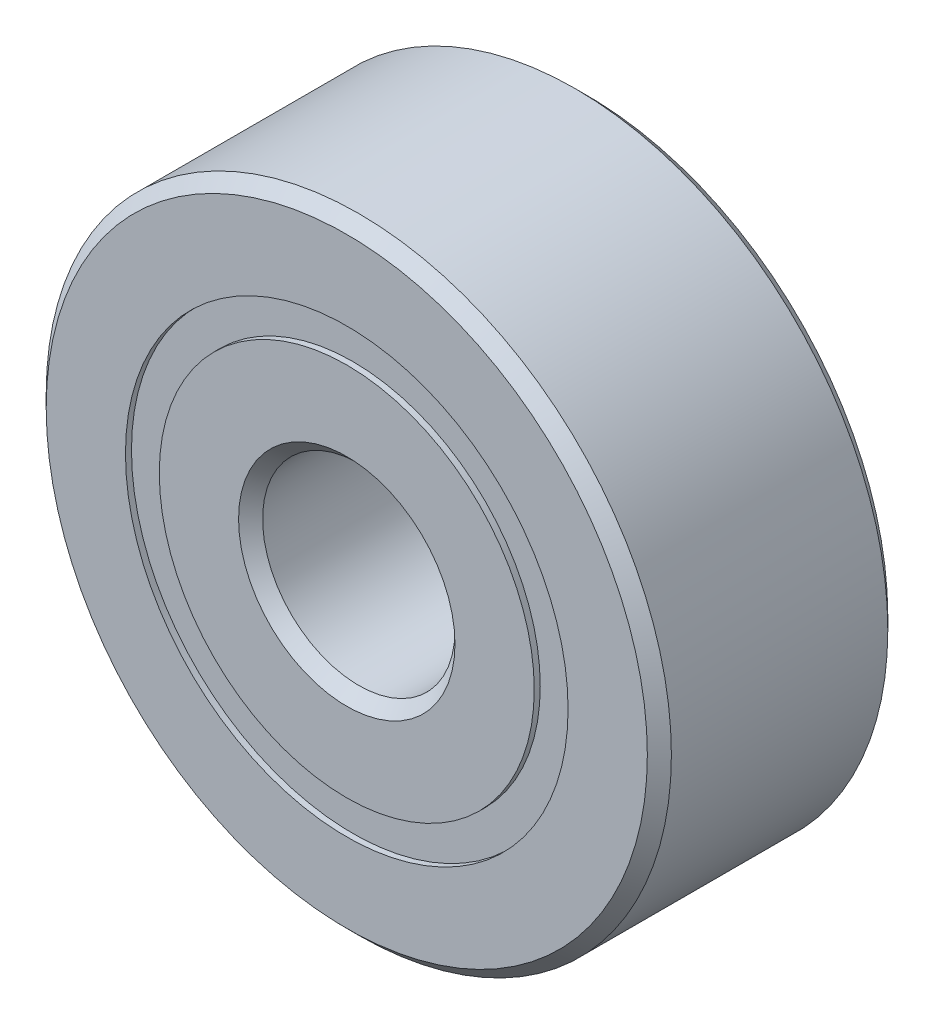
ISO-10303-21;
HEADER;
FILE_DESCRIPTION(('STEP AP214'),'2;1');
FILE_NAME('part.step','',(''),(''),'','','');
FILE_SCHEMA(('AUTOMOTIVE_DESIGN { 1 0 10303 214 1 1 1 1 }'));
ENDSEC;
DATA;
#1=APPLICATION_CONTEXT('core data for automotive mechanical design processes');
#2=APPLICATION_PROTOCOL_DEFINITION('international standard','automotive_design',2000,#1);
#3=PRODUCT_CONTEXT('',#1,'mechanical');
#4=PRODUCT('Part','Part','',(#3));
#5=PRODUCT_RELATED_PRODUCT_CATEGORY('part','',(#4));
#6=PRODUCT_DEFINITION_FORMATION('','',#4);
#7=PRODUCT_DEFINITION_CONTEXT('part definition',#1,'design');
#8=PRODUCT_DEFINITION('design','',#6,#7);
#9=PRODUCT_DEFINITION_SHAPE('','',#8);
#10=(LENGTH_UNIT() NAMED_UNIT(*) SI_UNIT(.MILLI.,.METRE.));
#11=(NAMED_UNIT(*) PLANE_ANGLE_UNIT() SI_UNIT($,.RADIAN.));
#12=(NAMED_UNIT(*) SI_UNIT($,.STERADIAN.) SOLID_ANGLE_UNIT());
#13=UNCERTAINTY_MEASURE_WITH_UNIT(LENGTH_MEASURE(1.E-05),#10,'distance_accuracy_value','');
#14=(GEOMETRIC_REPRESENTATION_CONTEXT(3) GLOBAL_UNCERTAINTY_ASSIGNED_CONTEXT((#13)) GLOBAL_UNIT_ASSIGNED_CONTEXT((#10,
#11,#12)) REPRESENTATION_CONTEXT('',''));
#15=CARTESIAN_POINT('',(0.,0.,0.));
#16=DIRECTION('',(0.,0.,1.));
#17=DIRECTION('',(1.,0.,0.));
#18=AXIS2_PLACEMENT_3D('',#15,#16,#17);
#19=CARTESIAN_POINT('',(0.,4.60164835164835,-2.375));
#20=DIRECTION('',(0.,0.,1.));
#21=DIRECTION('',(1.,0.,0.));
#22=AXIS2_PLACEMENT_3D('',#19,#20,#21);
#23=PLANE('',#22);
#24=CARTESIAN_POINT('',(0.,0.,-2.375));
#25=DIRECTION('',(0.,0.,1.));
#26=DIRECTION('',(1.,0.,0.));
#27=AXIS2_PLACEMENT_3D('',#24,#25,#26);
#28=CIRCLE('',#27,4.60164835164835);
#29=CARTESIAN_POINT('',(4.60164835164835,0.,-2.375));
#30=VERTEX_POINT('',#29);
#31=EDGE_CURVE('E64',#30,#30,#28,.T.);
#32=ORIENTED_EDGE('',*,*,#31,.F.);
#33=EDGE_LOOP('',(#32));
#34=FACE_BOUND('',#33,.T.);
#35=CARTESIAN_POINT('',(0.,0.,-2.375));
#36=DIRECTION('',(0.,0.,1.));
#37=DIRECTION('',(1.,0.,0.));
#38=AXIS2_PLACEMENT_3D('',#35,#36,#37);
#39=CIRCLE('',#38,3.89835164835165);
#40=CARTESIAN_POINT('',(3.89835164835165,0.,-2.375));
#41=VERTEX_POINT('',#40);
#42=EDGE_CURVE('E11',#41,#41,#39,.T.);
#43=ORIENTED_EDGE('',*,*,#42,.T.);
#44=EDGE_LOOP('',(#43));
#45=FACE_BOUND('',#44,.T.);
#46=ADVANCED_FACE('F50',(#34,#45),#23,.F.);
#47=CARTESIAN_POINT('',(0.,0.,2.5));
#48=DIRECTION('',(0.,0.,1.));
#49=DIRECTION('',(1.,0.,0.));
#50=AXIS2_PLACEMENT_3D('',#47,#48,#49);
#51=CYLINDRICAL_SURFACE('',#50,3.89835164835165);
#52=ORIENTED_EDGE('',*,*,#42,.F.);
#53=EDGE_LOOP('',(#52));
#54=FACE_BOUND('',#53,.T.);
#55=CARTESIAN_POINT('',(0.,0.,-1.16542887575844));
#56=DIRECTION('',(0.,0.,1.));
#57=DIRECTION('',(1.,0.,0.));
#58=AXIS2_PLACEMENT_3D('',#55,#56,#57);
#59=CIRCLE('',#58,3.89835164835165);
#60=CARTESIAN_POINT('',(3.89835164835165,0.,-1.16542887575844));
#61=VERTEX_POINT('',#60);
#62=EDGE_CURVE('E56',#61,#61,#59,.T.);
#63=ORIENTED_EDGE('',*,*,#62,.T.);
#64=EDGE_LOOP('',(#63));
#65=FACE_BOUND('',#64,.T.);
#66=ADVANCED_FACE('F73',(#54,#65),#51,.F.);
#67=CARTESIAN_POINT('',(0.,4.60164835164835,-1.16542887575844));
#68=DIRECTION('',(0.,0.,-1.));
#69=DIRECTION('',(-1.,0.,0.));
#70=AXIS2_PLACEMENT_3D('',#67,#68,#69);
#71=PLANE('',#70);
#72=ORIENTED_EDGE('',*,*,#62,.F.);
#73=EDGE_LOOP('',(#72));
#74=FACE_BOUND('',#73,.T.);
#75=CARTESIAN_POINT('',(0.,0.,-1.16542887575844));
#76=DIRECTION('',(0.,0.,1.));
#77=DIRECTION('',(1.,0.,0.));
#78=AXIS2_PLACEMENT_3D('',#75,#76,#77);
#79=CIRCLE('',#78,4.60164835164835);
#80=CARTESIAN_POINT('',(4.60164835164835,0.,-1.16542887575844));
#81=VERTEX_POINT('',#80);
#82=EDGE_CURVE('E60',#81,#81,#79,.T.);
#83=ORIENTED_EDGE('',*,*,#82,.T.);
#84=EDGE_LOOP('',(#83));
#85=FACE_BOUND('',#84,.T.);
#86=ADVANCED_FACE('F77',(#74,#85),#71,.F.);
#87=CARTESIAN_POINT('',(0.,0.,2.5));
#88=DIRECTION('',(0.,0.,1.));
#89=DIRECTION('',(1.,0.,0.));
#90=AXIS2_PLACEMENT_3D('',#87,#88,#89);
#91=CYLINDRICAL_SURFACE('',#90,4.60164835164835);
#92=ORIENTED_EDGE('',*,*,#82,.F.);
#93=EDGE_LOOP('',(#92));
#94=FACE_BOUND('',#93,.T.);
#95=ORIENTED_EDGE('',*,*,#31,.T.);
#96=EDGE_LOOP('',(#95));
#97=FACE_BOUND('',#96,.T.);
#98=ADVANCED_FACE('F70',(#94,#97),#91,.T.);
#99=CLOSED_SHELL('',(#46,#66,#86,#98));
#100=MANIFOLD_SOLID_BREP('B2',#99);
#101=CARTESIAN_POINT('',(0.,4.60164835164835,2.375));
#102=DIRECTION('',(0.,0.,-1.));
#103=DIRECTION('',(-1.,0.,0.));
#104=AXIS2_PLACEMENT_3D('',#101,#102,#103);
#105=PLANE('',#104);
#106=CARTESIAN_POINT('',(0.,0.,2.375));
#107=DIRECTION('',(0.,0.,1.));
#108=DIRECTION('',(1.,0.,0.));
#109=AXIS2_PLACEMENT_3D('',#106,#107,#108);
#110=CIRCLE('',#109,3.89835164835165);
#111=CARTESIAN_POINT('',(3.89835164835165,0.,2.375));
#112=VERTEX_POINT('',#111);
#113=EDGE_CURVE('E49',#112,#112,#110,.T.);
#114=ORIENTED_EDGE('',*,*,#113,.F.);
#115=EDGE_LOOP('',(#114));
#116=FACE_BOUND('',#115,.T.);
#117=CARTESIAN_POINT('',(0.,0.,2.375));
#118=DIRECTION('',(0.,0.,1.));
#119=DIRECTION('',(1.,0.,0.));
#120=AXIS2_PLACEMENT_3D('',#117,#118,#119);
#121=CIRCLE('',#120,4.60164835164835);
#122=CARTESIAN_POINT('',(4.60164835164835,0.,2.375));
#123=VERTEX_POINT('',#122);
#124=EDGE_CURVE('E124',#123,#123,#121,.T.);
#125=ORIENTED_EDGE('',*,*,#124,.T.);
#126=EDGE_LOOP('',(#125));
#127=FACE_BOUND('',#126,.T.);
#128=ADVANCED_FACE('F110',(#116,#127),#105,.F.);
#129=CARTESIAN_POINT('',(0.,0.,2.5));
#130=DIRECTION('',(0.,0.,1.));
#131=DIRECTION('',(1.,0.,0.));
#132=AXIS2_PLACEMENT_3D('',#129,#130,#131);
#133=CYLINDRICAL_SURFACE('',#132,3.89835164835165);
#134=CARTESIAN_POINT('',(0.,0.,1.16542887575844));
#135=DIRECTION('',(0.,0.,1.));
#136=DIRECTION('',(1.,0.,0.));
#137=AXIS2_PLACEMENT_3D('',#134,#135,#136);
#138=CIRCLE('',#137,3.89835164835165);
#139=CARTESIAN_POINT('',(3.89835164835165,0.,1.16542887575844));
#140=VERTEX_POINT('',#139);
#141=EDGE_CURVE('E116',#140,#140,#138,.T.);
#142=ORIENTED_EDGE('',*,*,#141,.F.);
#143=EDGE_LOOP('',(#142));
#144=FACE_BOUND('',#143,.T.);
#145=ORIENTED_EDGE('',*,*,#113,.T.);
#146=EDGE_LOOP('',(#145));
#147=FACE_BOUND('',#146,.T.);
#148=ADVANCED_FACE('F139',(#144,#147),#133,.F.);
#149=CARTESIAN_POINT('',(0.,4.60164835164835,1.16542887575844));
#150=DIRECTION('',(0.,0.,1.));
#151=DIRECTION('',(1.,0.,0.));
#152=AXIS2_PLACEMENT_3D('',#149,#150,#151);
#153=PLANE('',#152);
#154=CARTESIAN_POINT('',(0.,0.,1.16542887575844));
#155=DIRECTION('',(0.,0.,1.));
#156=DIRECTION('',(1.,0.,0.));
#157=AXIS2_PLACEMENT_3D('',#154,#155,#156);
#158=CIRCLE('',#157,4.60164835164835);
#159=CARTESIAN_POINT('',(4.60164835164835,0.,1.16542887575844));
#160=VERTEX_POINT('',#159);
#161=EDGE_CURVE('E120',#160,#160,#158,.T.);
#162=ORIENTED_EDGE('',*,*,#161,.F.);
#163=EDGE_LOOP('',(#162));
#164=FACE_BOUND('',#163,.T.);
#165=ORIENTED_EDGE('',*,*,#141,.T.);
#166=EDGE_LOOP('',(#165));
#167=FACE_BOUND('',#166,.T.);
#168=ADVANCED_FACE('F134',(#164,#167),#153,.F.);
#169=CARTESIAN_POINT('',(0.,0.,2.5));
#170=DIRECTION('',(0.,0.,1.));
#171=DIRECTION('',(1.,0.,0.));
#172=AXIS2_PLACEMENT_3D('',#169,#170,#171);
#173=CYLINDRICAL_SURFACE('',#172,4.60164835164835);
#174=ORIENTED_EDGE('',*,*,#124,.F.);
#175=EDGE_LOOP('',(#174));
#176=FACE_BOUND('',#175,.T.);
#177=ORIENTED_EDGE('',*,*,#161,.T.);
#178=EDGE_LOOP('',(#177));
#179=FACE_BOUND('',#178,.T.);
#180=ADVANCED_FACE('F131',(#176,#179),#173,.T.);
#181=CLOSED_SHELL('',(#128,#148,#168,#180));
#182=MANIFOLD_SOLID_BREP('B6',#181);
#183=CARTESIAN_POINT('',(-2.12499999999995,3.68060796608389,0.));
#184=DIRECTION('',(0.,0.,1.));
#185=DIRECTION('',(-0.499999999999989,0.866025403784445,0.));
#186=AXIS2_PLACEMENT_3D('',#183,#184,#185);
#187=SPHERICAL_SURFACE('',#186,1.16542887575844);
#188=CARTESIAN_POINT('',(-2.12499999999995,3.68060796608389,1.16542887575844));
#189=VERTEX_POINT('',#188);
#190=VERTEX_LOOP('',#189);
#191=FACE_BOUND('',#190,.T.);
#192=ADVANCED_FACE('F170',(#191),#187,.T.);
#193=CLOSED_SHELL('',(#192));
#194=MANIFOLD_SOLID_BREP('B44',#193);
#195=CARTESIAN_POINT('',(-3.68060796608384,2.12500000000004,0.));
#196=DIRECTION('',(0.,0.,1.));
#197=DIRECTION('',(-0.866025403784433,0.50000000000001,0.));
#198=AXIS2_PLACEMENT_3D('',#195,#196,#197);
#199=SPHERICAL_SURFACE('',#198,1.16542887575844);
#200=CARTESIAN_POINT('',(-3.68060796608384,2.12500000000004,1.16542887575844));
#201=VERTEX_POINT('',#200);
#202=VERTEX_LOOP('',#201);
#203=FACE_BOUND('',#202,.T.);
#204=ADVANCED_FACE('F193',(#203),#199,.T.);
#205=CLOSED_SHELL('',(#204));
#206=MANIFOLD_SOLID_BREP('B106',#205);
#207=CARTESIAN_POINT('',(-4.25,0.,0.));
#208=DIRECTION('',(0.,0.,1.));
#209=DIRECTION('',(-1.,0.,0.));
#210=AXIS2_PLACEMENT_3D('',#207,#208,#209);
#211=SPHERICAL_SURFACE('',#210,1.16542887575844);
#212=CARTESIAN_POINT('',(-4.25,0.,1.16542887575844));
#213=VERTEX_POINT('',#212);
#214=VERTEX_LOOP('',#213);
#215=FACE_BOUND('',#214,.T.);
#216=ADVANCED_FACE('F216',(#215),#211,.T.);
#217=CLOSED_SHELL('',(#216));
#218=MANIFOLD_SOLID_BREP('B166',#217);
#219=CARTESIAN_POINT('',(-3.68060796608388,-2.12499999999997,0.));
#220=DIRECTION('',(0.,0.,1.));
#221=DIRECTION('',(-0.866025403784443,-0.499999999999992,0.));
#222=AXIS2_PLACEMENT_3D('',#219,#220,#221);
#223=SPHERICAL_SURFACE('',#222,1.16542887575844);
#224=CARTESIAN_POINT('',(-3.68060796608388,-2.12499999999997,1.16542887575844));
#225=VERTEX_POINT('',#224);
#226=VERTEX_LOOP('',#225);
#227=FACE_BOUND('',#226,.T.);
#228=ADVANCED_FACE('F239',(#227),#223,.T.);
#229=CLOSED_SHELL('',(#228));
#230=MANIFOLD_SOLID_BREP('B189',#229);
#231=CARTESIAN_POINT('',(-2.12500000000003,-3.68060796608385,0.));
#232=DIRECTION('',(0.,0.,1.));
#233=DIRECTION('',(-0.500000000000007,-0.866025403784435,0.));
#234=AXIS2_PLACEMENT_3D('',#231,#232,#233);
#235=SPHERICAL_SURFACE('',#234,1.16542887575844);
#236=CARTESIAN_POINT('',(-2.12500000000003,-3.68060796608385,1.16542887575844));
#237=VERTEX_POINT('',#236);
#238=VERTEX_LOOP('',#237);
#239=FACE_BOUND('',#238,.T.);
#240=ADVANCED_FACE('F262',(#239),#235,.T.);
#241=CLOSED_SHELL('',(#240));
#242=MANIFOLD_SOLID_BREP('B212',#241);
#243=CARTESIAN_POINT('',(0.,-4.25,0.));
#244=DIRECTION('',(0.,0.,1.));
#245=DIRECTION('',(0.,-1.,0.));
#246=AXIS2_PLACEMENT_3D('',#243,#244,#245);
#247=SPHERICAL_SURFACE('',#246,1.16542887575844);
#248=CARTESIAN_POINT('',(0.,-4.25,1.16542887575844));
#249=VERTEX_POINT('',#248);
#250=VERTEX_LOOP('',#249);
#251=FACE_BOUND('',#250,.T.);
#252=ADVANCED_FACE('F285',(#251),#247,.T.);
#253=CLOSED_SHELL('',(#252));
#254=MANIFOLD_SOLID_BREP('B235',#253);
#255=CARTESIAN_POINT('',(2.12499999999998,-3.68060796608388,0.));
#256=DIRECTION('',(0.,0.,1.));
#257=DIRECTION('',(0.499999999999995,-0.866025403784442,0.));
#258=AXIS2_PLACEMENT_3D('',#255,#256,#257);
#259=SPHERICAL_SURFACE('',#258,1.16542887575844);
#260=CARTESIAN_POINT('',(2.12499999999998,-3.68060796608388,1.16542887575844));
#261=VERTEX_POINT('',#260);
#262=VERTEX_LOOP('',#261);
#263=FACE_BOUND('',#262,.T.);
#264=ADVANCED_FACE('F308',(#263),#259,.T.);
#265=CLOSED_SHELL('',(#264));
#266=MANIFOLD_SOLID_BREP('B258',#265);
#267=CARTESIAN_POINT('',(3.68060796608386,-2.12500000000002,0.));
#268=DIRECTION('',(0.,0.,1.));
#269=DIRECTION('',(0.866025403784436,-0.500000000000004,0.));
#270=AXIS2_PLACEMENT_3D('',#267,#268,#269);
#271=SPHERICAL_SURFACE('',#270,1.16542887575844);
#272=CARTESIAN_POINT('',(3.68060796608386,-2.12500000000002,1.16542887575844));
#273=VERTEX_POINT('',#272);
#274=VERTEX_LOOP('',#273);
#275=FACE_BOUND('',#274,.T.);
#276=ADVANCED_FACE('F331',(#275),#271,.T.);
#277=CLOSED_SHELL('',(#276));
#278=MANIFOLD_SOLID_BREP('B281',#277);
#279=CARTESIAN_POINT('',(4.25,0.,0.));
#280=DIRECTION('',(0.,0.,1.));
#281=DIRECTION('',(1.,0.,0.));
#282=AXIS2_PLACEMENT_3D('',#279,#280,#281);
#283=SPHERICAL_SURFACE('',#282,1.16542887575844);
#284=CARTESIAN_POINT('',(4.25,0.,1.16542887575844));
#285=VERTEX_POINT('',#284);
#286=VERTEX_LOOP('',#285);
#287=FACE_BOUND('',#286,.T.);
#288=ADVANCED_FACE('F354',(#287),#283,.T.);
#289=CLOSED_SHELL('',(#288));
#290=MANIFOLD_SOLID_BREP('B304',#289);
#291=CARTESIAN_POINT('',(3.68060796608387,2.12499999999999,0.));
#292=DIRECTION('',(0.,0.,1.));
#293=DIRECTION('',(0.86602540378444,0.499999999999998,0.));
#294=AXIS2_PLACEMENT_3D('',#291,#292,#293);
#295=SPHERICAL_SURFACE('',#294,1.16542887575844);
#296=CARTESIAN_POINT('',(3.68060796608387,2.12499999999999,1.16542887575844));
#297=VERTEX_POINT('',#296);
#298=VERTEX_LOOP('',#297);
#299=FACE_BOUND('',#298,.T.);
#300=ADVANCED_FACE('F377',(#299),#295,.T.);
#301=CLOSED_SHELL('',(#300));
#302=MANIFOLD_SOLID_BREP('B327',#301);
#303=CARTESIAN_POINT('',(2.125,3.68060796608386,0.));
#304=DIRECTION('',(0.,0.,1.));
#305=DIRECTION('',(0.500000000000001,0.866025403784438,0.));
#306=AXIS2_PLACEMENT_3D('',#303,#304,#305);
#307=SPHERICAL_SURFACE('',#306,1.16542887575844);
#308=CARTESIAN_POINT('',(2.125,3.68060796608386,1.16542887575844));
#309=VERTEX_POINT('',#308);
#310=VERTEX_LOOP('',#309);
#311=FACE_BOUND('',#310,.T.);
#312=ADVANCED_FACE('F400',(#311),#307,.T.);
#313=CLOSED_SHELL('',(#312));
#314=MANIFOLD_SOLID_BREP('B350',#313);
#315=CARTESIAN_POINT('',(0.,4.25,0.));
#316=DIRECTION('',(0.,0.,1.));
#317=DIRECTION('',(0.,1.,0.));
#318=AXIS2_PLACEMENT_3D('',#315,#316,#317);
#319=SPHERICAL_SURFACE('',#318,1.16542887575844);
#320=CARTESIAN_POINT('',(0.,4.25,1.16542887575844));
#321=VERTEX_POINT('',#320);
#322=VERTEX_LOOP('',#321);
#323=FACE_BOUND('',#322,.T.);
#324=ADVANCED_FACE('F425',(#323),#319,.T.);
#325=CLOSED_SHELL('',(#324));
#326=MANIFOLD_SOLID_BREP('B373',#325);
#327=CARTESIAN_POINT('',(0.,3.89835164835165,2.5));
#328=DIRECTION('',(0.,0.,-1.));
#329=DIRECTION('',(-1.,0.,0.));
#330=AXIS2_PLACEMENT_3D('',#327,#328,#329);
#331=PLANE('',#330);
#332=CARTESIAN_POINT('',(0.,0.,2.5));
#333=DIRECTION('',(0.,0.,1.));
#334=DIRECTION('',(1.,0.,0.));
#335=AXIS2_PLACEMENT_3D('',#332,#333,#334);
#336=CIRCLE('',#335,2.25);
#337=CARTESIAN_POINT('',(2.25,0.,2.5));
#338=VERTEX_POINT('',#337);
#339=EDGE_CURVE('E471',#338,#338,#336,.T.);
#340=ORIENTED_EDGE('',*,*,#339,.F.);
#341=EDGE_LOOP('',(#340));
#342=FACE_BOUND('',#341,.T.);
#343=CARTESIAN_POINT('',(0.,0.,2.5));
#344=DIRECTION('',(0.,0.,1.));
#345=DIRECTION('',(1.,0.,0.));
#346=AXIS2_PLACEMENT_3D('',#343,#344,#345);
#347=CIRCLE('',#346,3.89835164835165);
#348=CARTESIAN_POINT('',(3.89835164835165,0.,2.5));
#349=VERTEX_POINT('',#348);
#350=EDGE_CURVE('E424',#349,#349,#347,.T.);
#351=ORIENTED_EDGE('',*,*,#350,.T.);
#352=EDGE_LOOP('',(#351));
#353=FACE_BOUND('',#352,.T.);
#354=ADVANCED_FACE('F443',(#342,#353),#331,.F.);
#355=CARTESIAN_POINT('',(0.,0.,2.5));
#356=DIRECTION('',(0.,0.,1.));
#357=DIRECTION('',(1.,0.,0.));
#358=AXIS2_PLACEMENT_3D('',#355,#356,#357);
#359=CYLINDRICAL_SURFACE('',#358,3.89835164835165);
#360=ORIENTED_EDGE('',*,*,#350,.F.);
#361=EDGE_LOOP('',(#360));
#362=FACE_BOUND('',#361,.T.);
#363=CARTESIAN_POINT('',(0.,0.,1.11111111111111));
#364=DIRECTION('',(0.,0.,1.));
#365=DIRECTION('',(1.,0.,0.));
#366=AXIS2_PLACEMENT_3D('',#363,#364,#365);
#367=CIRCLE('',#366,3.89835164835165);
#368=CARTESIAN_POINT('',(3.89835164835165,0.,1.11111111111111));
#369=VERTEX_POINT('',#368);
#370=EDGE_CURVE('E449',#369,#369,#367,.T.);
#371=ORIENTED_EDGE('',*,*,#370,.T.);
#372=EDGE_LOOP('',(#371));
#373=FACE_BOUND('',#372,.T.);
#374=ADVANCED_FACE('F478',(#362,#373),#359,.T.);
#375=CARTESIAN_POINT('',(0.,0.,0.));
#376=DIRECTION('',(0.,0.,1.));
#377=DIRECTION('',(1.,0.,0.));
#378=AXIS2_PLACEMENT_3D('',#375,#376,#377);
#379=TOROIDAL_SURFACE('',#378,4.25,1.16542887575843);
#380=ORIENTED_EDGE('',*,*,#370,.F.);
#381=EDGE_LOOP('',(#380));
#382=FACE_BOUND('',#381,.T.);
#383=CARTESIAN_POINT('',(0.,0.,-1.11111111111111));
#384=DIRECTION('',(0.,0.,1.));
#385=DIRECTION('',(1.,0.,0.));
#386=AXIS2_PLACEMENT_3D('',#383,#384,#385);
#387=CIRCLE('',#386,3.89835164835165);
#388=CARTESIAN_POINT('',(3.89835164835165,0.,-1.11111111111111));
#389=VERTEX_POINT('',#388);
#390=EDGE_CURVE('E453',#389,#389,#387,.T.);
#391=ORIENTED_EDGE('',*,*,#390,.T.);
#392=EDGE_LOOP('',(#391));
#393=FACE_BOUND('',#392,.T.);
#394=ADVANCED_FACE('F482',(#382,#393),#379,.F.);
#395=CARTESIAN_POINT('',(0.,0.,2.5));
#396=DIRECTION('',(0.,0.,1.));
#397=DIRECTION('',(1.,0.,0.));
#398=AXIS2_PLACEMENT_3D('',#395,#396,#397);
#399=CYLINDRICAL_SURFACE('',#398,3.89835164835165);
#400=ORIENTED_EDGE('',*,*,#390,.F.);
#401=EDGE_LOOP('',(#400));
#402=FACE_BOUND('',#401,.T.);
#403=CARTESIAN_POINT('',(0.,0.,-2.5));
#404=DIRECTION('',(0.,0.,1.));
#405=DIRECTION('',(1.,0.,0.));
#406=AXIS2_PLACEMENT_3D('',#403,#404,#405);
#407=CIRCLE('',#406,3.89835164835165);
#408=CARTESIAN_POINT('',(3.89835164835165,0.,-2.5));
#409=VERTEX_POINT('',#408);
#410=EDGE_CURVE('E457',#409,#409,#407,.T.);
#411=ORIENTED_EDGE('',*,*,#410,.T.);
#412=EDGE_LOOP('',(#411));
#413=FACE_BOUND('',#412,.T.);
#414=ADVANCED_FACE('F487',(#402,#413),#399,.T.);
#415=CARTESIAN_POINT('',(0.,2.25,-2.5));
#416=DIRECTION('',(0.,0.,1.));
#417=DIRECTION('',(1.,0.,0.));
#418=AXIS2_PLACEMENT_3D('',#415,#416,#417);
#419=PLANE('',#418);
#420=ORIENTED_EDGE('',*,*,#410,.F.);
#421=EDGE_LOOP('',(#420));
#422=FACE_BOUND('',#421,.T.);
#423=CARTESIAN_POINT('',(0.,0.,-2.5));
#424=DIRECTION('',(0.,0.,1.));
#425=DIRECTION('',(1.,0.,0.));
#426=AXIS2_PLACEMENT_3D('',#423,#424,#425);
#427=CIRCLE('',#426,2.25);
#428=CARTESIAN_POINT('',(2.25,0.,-2.5));
#429=VERTEX_POINT('',#428);
#430=EDGE_CURVE('E462',#429,#429,#427,.T.);
#431=ORIENTED_EDGE('',*,*,#430,.T.);
#432=EDGE_LOOP('',(#431));
#433=FACE_BOUND('',#432,.T.);
#434=ADVANCED_FACE('F493',(#422,#433),#419,.F.);
#435=CARTESIAN_POINT('',(0.,0.,-2.25));
#436=DIRECTION('',(0.,0.,-1.));
#437=DIRECTION('',(-1.,0.,0.));
#438=AXIS2_PLACEMENT_3D('',#435,#436,#437);
#439=CONICAL_SURFACE('',#438,2.,0.785398163397445);
#440=ORIENTED_EDGE('',*,*,#430,.F.);
#441=EDGE_LOOP('',(#440));
#442=FACE_BOUND('',#441,.T.);
#443=CARTESIAN_POINT('',(0.,0.,-2.25));
#444=DIRECTION('',(0.,0.,1.));
#445=DIRECTION('',(1.,0.,0.));
#446=AXIS2_PLACEMENT_3D('',#443,#444,#445);
#447=CIRCLE('',#446,2.);
#448=CARTESIAN_POINT('',(2.,0.,-2.25));
#449=VERTEX_POINT('',#448);
#450=EDGE_CURVE('E465',#449,#449,#447,.T.);
#451=ORIENTED_EDGE('',*,*,#450,.T.);
#452=EDGE_LOOP('',(#451));
#453=FACE_BOUND('',#452,.T.);
#454=ADVANCED_FACE('F497',(#442,#453),#439,.F.);
#455=CARTESIAN_POINT('',(0.,0.,2.5));
#456=DIRECTION('',(0.,0.,1.));
#457=DIRECTION('',(1.,0.,0.));
#458=AXIS2_PLACEMENT_3D('',#455,#456,#457);
#459=CYLINDRICAL_SURFACE('',#458,2.);
#460=ORIENTED_EDGE('',*,*,#450,.F.);
#461=EDGE_LOOP('',(#460));
#462=FACE_BOUND('',#461,.T.);
#463=CARTESIAN_POINT('',(0.,0.,2.25));
#464=DIRECTION('',(0.,0.,1.));
#465=DIRECTION('',(1.,0.,0.));
#466=AXIS2_PLACEMENT_3D('',#463,#464,#465);
#467=CIRCLE('',#466,2.);
#468=CARTESIAN_POINT('',(2.,0.,2.25));
#469=VERTEX_POINT('',#468);
#470=EDGE_CURVE('E468',#469,#469,#467,.T.);
#471=ORIENTED_EDGE('',*,*,#470,.T.);
#472=EDGE_LOOP('',(#471));
#473=FACE_BOUND('',#472,.T.);
#474=ADVANCED_FACE('F501',(#462,#473),#459,.F.);
#475=CARTESIAN_POINT('',(0.,0.,2.5));
#476=DIRECTION('',(0.,0.,1.));
#477=DIRECTION('',(1.,0.,0.));
#478=AXIS2_PLACEMENT_3D('',#475,#476,#477);
#479=CONICAL_SURFACE('',#478,2.25,0.785398163397452);
#480=ORIENTED_EDGE('',*,*,#470,.F.);
#481=EDGE_LOOP('',(#480));
#482=FACE_BOUND('',#481,.T.);
#483=ORIENTED_EDGE('',*,*,#339,.T.);
#484=EDGE_LOOP('',(#483));
#485=FACE_BOUND('',#484,.T.);
#486=ADVANCED_FACE('F475',(#482,#485),#479,.F.);
#487=CLOSED_SHELL('',(#354,#374,#394,#414,#434,#454,#474,#486));
#488=MANIFOLD_SOLID_BREP('B396',#487);
#489=CARTESIAN_POINT('',(0.,0.,2.25));
#490=DIRECTION('',(0.,0.,-1.));
#491=DIRECTION('',(-1.,0.,0.));
#492=AXIS2_PLACEMENT_3D('',#489,#490,#491);
#493=CONICAL_SURFACE('',#492,6.5,0.785398163397445);
#494=CARTESIAN_POINT('',(0.,0.,2.5));
#495=DIRECTION('',(0.,0.,1.));
#496=DIRECTION('',(1.,0.,0.));
#497=AXIS2_PLACEMENT_3D('',#494,#495,#496);
#498=CIRCLE('',#497,6.25);
#499=CARTESIAN_POINT('',(6.25,0.,2.5));
#500=VERTEX_POINT('',#499);
#501=EDGE_CURVE('E577',#500,#500,#498,.T.);
#502=ORIENTED_EDGE('',*,*,#501,.F.);
#503=EDGE_LOOP('',(#502));
#504=FACE_BOUND('',#503,.T.);
#505=CARTESIAN_POINT('',(0.,0.,2.25));
#506=DIRECTION('',(0.,0.,1.));
#507=DIRECTION('',(1.,0.,0.));
#508=AXIS2_PLACEMENT_3D('',#505,#506,#507);
#509=CIRCLE('',#508,6.5);
#510=CARTESIAN_POINT('',(6.5,0.,2.25));
#511=VERTEX_POINT('',#510);
#512=EDGE_CURVE('E442',#511,#511,#509,.T.);
#513=ORIENTED_EDGE('',*,*,#512,.T.);
#514=EDGE_LOOP('',(#513));
#515=FACE_BOUND('',#514,.T.);
#516=ADVANCED_FACE('F549',(#504,#515),#493,.T.);
#517=CARTESIAN_POINT('',(0.,0.,2.5));
#518=DIRECTION('',(0.,0.,1.));
#519=DIRECTION('',(1.,0.,0.));
#520=AXIS2_PLACEMENT_3D('',#517,#518,#519);
#521=CYLINDRICAL_SURFACE('',#520,6.5);
#522=ORIENTED_EDGE('',*,*,#512,.F.);
#523=EDGE_LOOP('',(#522));
#524=FACE_BOUND('',#523,.T.);
#525=CARTESIAN_POINT('',(0.,0.,-2.25));
#526=DIRECTION('',(0.,0.,1.));
#527=DIRECTION('',(1.,0.,0.));
#528=AXIS2_PLACEMENT_3D('',#525,#526,#527);
#529=CIRCLE('',#528,6.5);
#530=CARTESIAN_POINT('',(6.5,0.,-2.25));
#531=VERTEX_POINT('',#530);
#532=EDGE_CURVE('E555',#531,#531,#529,.T.);
#533=ORIENTED_EDGE('',*,*,#532,.T.);
#534=EDGE_LOOP('',(#533));
#535=FACE_BOUND('',#534,.T.);
#536=ADVANCED_FACE('F584',(#524,#535),#521,.T.);
#537=CARTESIAN_POINT('',(0.,0.,-2.5));
#538=DIRECTION('',(0.,0.,1.));
#539=DIRECTION('',(1.,0.,0.));
#540=AXIS2_PLACEMENT_3D('',#537,#538,#539);
#541=CONICAL_SURFACE('',#540,6.25,0.785398163397445);
#542=ORIENTED_EDGE('',*,*,#532,.F.);
#543=EDGE_LOOP('',(#542));
#544=FACE_BOUND('',#543,.T.);
#545=CARTESIAN_POINT('',(0.,0.,-2.5));
#546=DIRECTION('',(0.,0.,1.));
#547=DIRECTION('',(1.,0.,0.));
#548=AXIS2_PLACEMENT_3D('',#545,#546,#547);
#549=CIRCLE('',#548,6.25);
#550=CARTESIAN_POINT('',(6.25,0.,-2.5));
#551=VERTEX_POINT('',#550);
#552=EDGE_CURVE('E559',#551,#551,#549,.T.);
#553=ORIENTED_EDGE('',*,*,#552,.T.);
#554=EDGE_LOOP('',(#553));
#555=FACE_BOUND('',#554,.T.);
#556=ADVANCED_FACE('F588',(#544,#555),#541,.T.);
#557=CARTESIAN_POINT('',(0.,6.25,-2.5));
#558=DIRECTION('',(0.,0.,1.));
#559=DIRECTION('',(1.,0.,0.));
#560=AXIS2_PLACEMENT_3D('',#557,#558,#559);
#561=PLANE('',#560);
#562=ORIENTED_EDGE('',*,*,#552,.F.);
#563=EDGE_LOOP('',(#562));
#564=FACE_BOUND('',#563,.T.);
#565=CARTESIAN_POINT('',(0.,0.,-2.5));
#566=DIRECTION('',(0.,0.,1.));
#567=DIRECTION('',(1.,0.,0.));
#568=AXIS2_PLACEMENT_3D('',#565,#566,#567);
#569=CIRCLE('',#568,4.60164835164835);
#570=CARTESIAN_POINT('',(4.60164835164835,0.,-2.5));
#571=VERTEX_POINT('',#570);
#572=EDGE_CURVE('E563',#571,#571,#569,.T.);
#573=ORIENTED_EDGE('',*,*,#572,.T.);
#574=EDGE_LOOP('',(#573));
#575=FACE_BOUND('',#574,.T.);
#576=ADVANCED_FACE('F593',(#564,#575),#561,.F.);
#577=CARTESIAN_POINT('',(0.,0.,2.5));
#578=DIRECTION('',(0.,0.,1.));
#579=DIRECTION('',(1.,0.,0.));
#580=AXIS2_PLACEMENT_3D('',#577,#578,#579);
#581=CYLINDRICAL_SURFACE('',#580,4.60164835164835);
#582=ORIENTED_EDGE('',*,*,#572,.F.);
#583=EDGE_LOOP('',(#582));
#584=FACE_BOUND('',#583,.T.);
#585=CARTESIAN_POINT('',(0.,0.,-1.11111111111111));
#586=DIRECTION('',(0.,0.,1.));
#587=DIRECTION('',(1.,0.,0.));
#588=AXIS2_PLACEMENT_3D('',#585,#586,#587);
#589=CIRCLE('',#588,4.60164835164835);
#590=CARTESIAN_POINT('',(4.60164835164835,0.,-1.11111111111111));
#591=VERTEX_POINT('',#590);
#592=EDGE_CURVE('E568',#591,#591,#589,.T.);
#593=ORIENTED_EDGE('',*,*,#592,.T.);
#594=EDGE_LOOP('',(#593));
#595=FACE_BOUND('',#594,.T.);
#596=ADVANCED_FACE('F599',(#584,#595),#581,.F.);
#597=CARTESIAN_POINT('',(0.,0.,0.));
#598=DIRECTION('',(0.,0.,1.));
#599=DIRECTION('',(1.,0.,0.));
#600=AXIS2_PLACEMENT_3D('',#597,#598,#599);
#601=TOROIDAL_SURFACE('',#600,4.25,1.16542887575844);
#602=ORIENTED_EDGE('',*,*,#592,.F.);
#603=EDGE_LOOP('',(#602));
#604=FACE_BOUND('',#603,.T.);
#605=CARTESIAN_POINT('',(0.,0.,1.11111111111111));
#606=DIRECTION('',(0.,0.,1.));
#607=DIRECTION('',(1.,0.,0.));
#608=AXIS2_PLACEMENT_3D('',#605,#606,#607);
#609=CIRCLE('',#608,4.60164835164835);
#610=CARTESIAN_POINT('',(4.60164835164835,0.,1.11111111111111));
#611=VERTEX_POINT('',#610);
#612=EDGE_CURVE('E571',#611,#611,#609,.T.);
#613=ORIENTED_EDGE('',*,*,#612,.T.);
#614=EDGE_LOOP('',(#613));
#615=FACE_BOUND('',#614,.T.);
#616=ADVANCED_FACE('F603',(#604,#615),#601,.F.);
#617=CARTESIAN_POINT('',(0.,0.,2.5));
#618=DIRECTION('',(0.,0.,1.));
#619=DIRECTION('',(1.,0.,0.));
#620=AXIS2_PLACEMENT_3D('',#617,#618,#619);
#621=CYLINDRICAL_SURFACE('',#620,4.60164835164835);
#622=ORIENTED_EDGE('',*,*,#612,.F.);
#623=EDGE_LOOP('',(#622));
#624=FACE_BOUND('',#623,.T.);
#625=CARTESIAN_POINT('',(0.,0.,2.5));
#626=DIRECTION('',(0.,0.,1.));
#627=DIRECTION('',(1.,0.,0.));
#628=AXIS2_PLACEMENT_3D('',#625,#626,#627);
#629=CIRCLE('',#628,4.60164835164835);
#630=CARTESIAN_POINT('',(4.60164835164835,0.,2.5));
#631=VERTEX_POINT('',#630);
#632=EDGE_CURVE('E574',#631,#631,#629,.T.);
#633=ORIENTED_EDGE('',*,*,#632,.T.);
#634=EDGE_LOOP('',(#633));
#635=FACE_BOUND('',#634,.T.);
#636=ADVANCED_FACE('F607',(#624,#635),#621,.F.);
#637=CARTESIAN_POINT('',(0.,6.25,2.5));
#638=DIRECTION('',(0.,0.,-1.));
#639=DIRECTION('',(-1.,0.,0.));
#640=AXIS2_PLACEMENT_3D('',#637,#638,#639);
#641=PLANE('',#640);
#642=ORIENTED_EDGE('',*,*,#632,.F.);
#643=EDGE_LOOP('',(#642));
#644=FACE_BOUND('',#643,.T.);
#645=ORIENTED_EDGE('',*,*,#501,.T.);
#646=EDGE_LOOP('',(#645));
#647=FACE_BOUND('',#646,.T.);
#648=ADVANCED_FACE('F581',(#644,#647),#641,.F.);
#649=CLOSED_SHELL('',(#516,#536,#556,#576,#596,#616,#636,#648));
#650=MANIFOLD_SOLID_BREP('B419',#649);
#651=ADVANCED_BREP_SHAPE_REPRESENTATION('',(#18,#100,#182,#194,#206,#218,#230,#242,#254,#266,
#278,#290,#302,#314,#326,#488,#650),#14);
#652=SHAPE_DEFINITION_REPRESENTATION(#9,#651);
ENDSEC;
END-ISO-10303-21;
